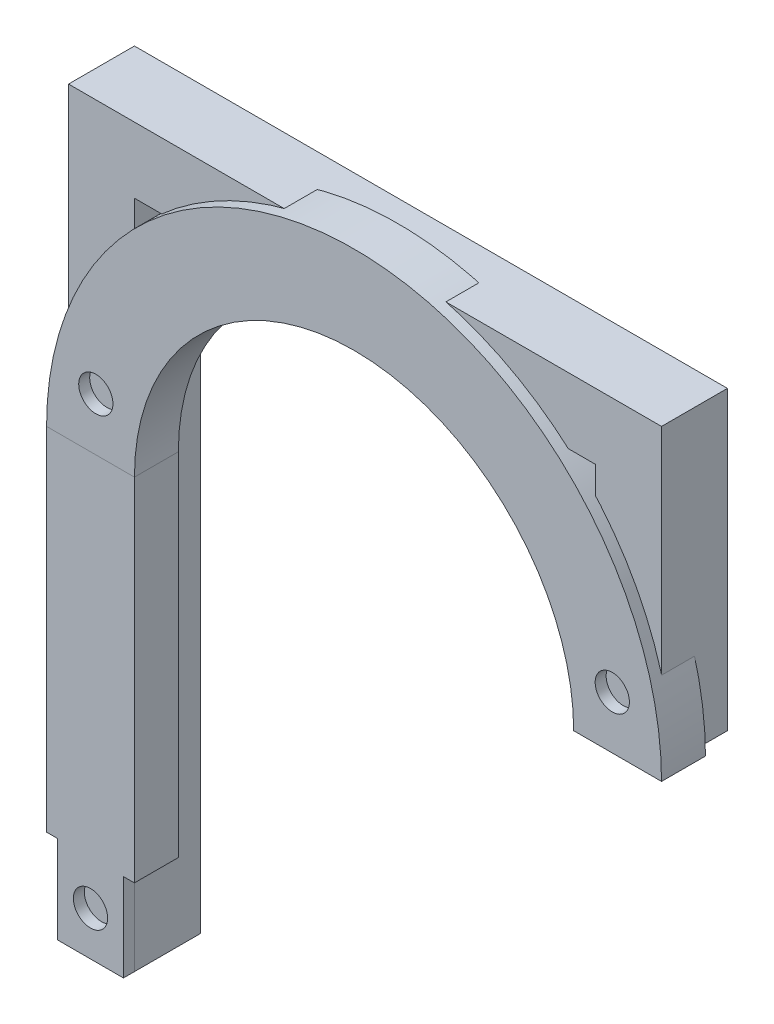
ISO-10303-21;
HEADER;
FILE_DESCRIPTION(('STEP AP214'),'2;1');
FILE_NAME('part.step','',(''),(''),'','','');
FILE_SCHEMA(('AUTOMOTIVE_DESIGN { 1 0 10303 214 1 1 1 1 }'));
ENDSEC;
DATA;
#1=APPLICATION_CONTEXT('core data for automotive mechanical design processes');
#2=APPLICATION_PROTOCOL_DEFINITION('international standard','automotive_design',2000,#1);
#3=PRODUCT_CONTEXT('',#1,'mechanical');
#4=PRODUCT('Part','Part','',(#3));
#5=PRODUCT_RELATED_PRODUCT_CATEGORY('part','',(#4));
#6=PRODUCT_DEFINITION_FORMATION('','',#4);
#7=PRODUCT_DEFINITION_CONTEXT('part definition',#1,'design');
#8=PRODUCT_DEFINITION('design','',#6,#7);
#9=PRODUCT_DEFINITION_SHAPE('','',#8);
#10=(LENGTH_UNIT() NAMED_UNIT(*) SI_UNIT(.MILLI.,.METRE.));
#11=(NAMED_UNIT(*) PLANE_ANGLE_UNIT() SI_UNIT($,.RADIAN.));
#12=(NAMED_UNIT(*) SI_UNIT($,.STERADIAN.) SOLID_ANGLE_UNIT());
#13=UNCERTAINTY_MEASURE_WITH_UNIT(LENGTH_MEASURE(1.E-05),#10,'distance_accuracy_value','');
#14=(GEOMETRIC_REPRESENTATION_CONTEXT(3) GLOBAL_UNCERTAINTY_ASSIGNED_CONTEXT((#13)) GLOBAL_UNIT_ASSIGNED_CONTEXT((#10,
#11,#12)) REPRESENTATION_CONTEXT('',''));
#15=CARTESIAN_POINT('',(0.,0.,0.));
#16=DIRECTION('',(0.,0.,1.));
#17=DIRECTION('',(1.,0.,0.));
#18=AXIS2_PLACEMENT_3D('',#15,#16,#17);
#19=CARTESIAN_POINT('',(-6.35,0.,0.));
#20=DIRECTION('',(-1.,0.,0.));
#21=DIRECTION('',(0.,0.,1.));
#22=AXIS2_PLACEMENT_3D('',#19,#20,#21);
#23=PLANE('',#22);
#24=DIRECTION('',(0.,1.,0.));
#25=VECTOR('',#24,1.);
#26=CARTESIAN_POINT('',(-6.35,0.,0.));
#27=LINE('',#26,#25);
#28=CARTESIAN_POINT('',(-6.35,12.7,0.));
#29=VERTEX_POINT('',#28);
#30=CARTESIAN_POINT('',(-6.35,63.5,0.));
#31=VERTEX_POINT('',#30);
#32=EDGE_CURVE('E160',#29,#31,#27,.T.);
#33=ORIENTED_EDGE('',*,*,#32,.F.);
#34=DIRECTION('',(0.,0.,-1.));
#35=VECTOR('',#34,1.);
#36=CARTESIAN_POINT('',(-6.35,12.7,6.35));
#37=LINE('',#36,#35);
#38=CARTESIAN_POINT('',(-6.35,12.7,6.35));
#39=VERTEX_POINT('',#38);
#40=EDGE_CURVE('E142',#39,#29,#37,.T.);
#41=ORIENTED_EDGE('',*,*,#40,.F.);
#42=DIRECTION('',(0.,1.,0.));
#43=VECTOR('',#42,1.);
#44=CARTESIAN_POINT('',(-6.35,0.,6.35));
#45=LINE('',#44,#43);
#46=CARTESIAN_POINT('',(-6.35,63.5,6.35));
#47=VERTEX_POINT('',#46);
#48=EDGE_CURVE('E172',#39,#47,#45,.T.);
#49=ORIENTED_EDGE('',*,*,#48,.T.);
#50=DIRECTION('',(0.,0.,1.));
#51=VECTOR('',#50,1.);
#52=CARTESIAN_POINT('',(-6.35,63.5,0.));
#53=LINE('',#52,#51);
#54=EDGE_CURVE('E169',#31,#47,#53,.T.);
#55=ORIENTED_EDGE('',*,*,#54,.F.);
#56=EDGE_LOOP('',(#33,#41,#49,#55));
#57=FACE_BOUND('',#56,.T.);
#58=ADVANCED_FACE('F45',(#57),#23,.T.);
#59=CARTESIAN_POINT('',(-6.35,0.,6.35));
#60=DIRECTION('',(0.,0.,1.));
#61=DIRECTION('',(1.,0.,0.));
#62=AXIS2_PLACEMENT_3D('',#59,#60,#61);
#63=PLANE('',#62);
#64=CARTESIAN_POINT('',(0.,6.35,6.35));
#65=DIRECTION('',(0.,0.,1.));
#66=DIRECTION('',(1.,0.,0.));
#67=AXIS2_PLACEMENT_3D('',#64,#65,#66);
#68=CIRCLE('',#67,2.4765);
#69=CARTESIAN_POINT('',(2.4765,6.35,6.35));
#70=VERTEX_POINT('',#69);
#71=EDGE_CURVE('E254',#70,#70,#68,.T.);
#72=ORIENTED_EDGE('',*,*,#71,.F.);
#73=EDGE_LOOP('',(#72));
#74=FACE_BOUND('',#73,.T.);
#75=ORIENTED_EDGE('',*,*,#48,.F.);
#76=DIRECTION('',(-1.,0.,0.));
#77=VECTOR('',#76,1.);
#78=CARTESIAN_POINT('',(-6.35,12.7,6.35));
#79=LINE('',#78,#77);
#80=CARTESIAN_POINT('',(-4.7625,12.7,6.35));
#81=VERTEX_POINT('',#80);
#82=EDGE_CURVE('E153',#81,#39,#79,.T.);
#83=ORIENTED_EDGE('',*,*,#82,.F.);
#84=DIRECTION('',(0.,1.,0.));
#85=VECTOR('',#84,1.);
#86=CARTESIAN_POINT('',(-4.7625,0.,6.35));
#87=LINE('',#86,#85);
#88=CARTESIAN_POINT('',(-4.7625,0.,6.35));
#89=VERTEX_POINT('',#88);
#90=EDGE_CURVE('E250',#89,#81,#87,.T.);
#91=ORIENTED_EDGE('',*,*,#90,.F.);
#92=DIRECTION('',(-1.,0.,0.));
#93=VECTOR('',#92,1.);
#94=CARTESIAN_POINT('',(-4.7625,0.,6.35));
#95=LINE('',#94,#93);
#96=CARTESIAN_POINT('',(4.7625,0.,6.35));
#97=VERTEX_POINT('',#96);
#98=EDGE_CURVE('E135',#97,#89,#95,.T.);
#99=ORIENTED_EDGE('',*,*,#98,.F.);
#100=DIRECTION('',(0.,1.,0.));
#101=VECTOR('',#100,1.);
#102=CARTESIAN_POINT('',(4.7625,0.,6.35));
#103=LINE('',#102,#101);
#104=CARTESIAN_POINT('',(4.7625,12.7,6.35));
#105=VERTEX_POINT('',#104);
#106=EDGE_CURVE('E146',#97,#105,#103,.T.);
#107=ORIENTED_EDGE('',*,*,#106,.T.);
#108=CARTESIAN_POINT('',(6.35,12.7,6.35));
#109=VERTEX_POINT('',#108);
#110=EDGE_CURVE('E154',#109,#105,#79,.T.);
#111=ORIENTED_EDGE('',*,*,#110,.F.);
#112=DIRECTION('',(0.,1.,0.));
#113=VECTOR('',#112,1.);
#114=CARTESIAN_POINT('',(6.35,0.,6.35));
#115=LINE('',#114,#113);
#116=CARTESIAN_POINT('',(6.35,63.5,6.35));
#117=VERTEX_POINT('',#116);
#118=EDGE_CURVE('E188',#109,#117,#115,.T.);
#119=ORIENTED_EDGE('',*,*,#118,.T.);
#120=DIRECTION('',(1.,0.,0.));
#121=VECTOR('',#120,1.);
#122=CARTESIAN_POINT('',(-6.35,63.5,6.35));
#123=LINE('',#122,#121);
#124=EDGE_CURVE('E174',#47,#117,#123,.T.);
#125=ORIENTED_EDGE('',*,*,#124,.F.);
#126=EDGE_LOOP('',(#75,#83,#91,#99,#107,#111,#119,#125));
#127=FACE_BOUND('',#126,.T.);
#128=ADVANCED_FACE('F240',(#74,#127),#63,.T.);
#129=CARTESIAN_POINT('',(6.35,0.,0.));
#130=DIRECTION('',(1.,0.,0.));
#131=DIRECTION('',(0.,0.,-1.));
#132=AXIS2_PLACEMENT_3D('',#129,#130,#131);
#133=PLANE('',#132);
#134=ORIENTED_EDGE('',*,*,#118,.F.);
#135=DIRECTION('',(0.,0.,1.));
#136=VECTOR('',#135,1.);
#137=CARTESIAN_POINT('',(6.35,12.7,6.35));
#138=LINE('',#137,#136);
#139=CARTESIAN_POINT('',(6.35,12.7,0.));
#140=VERTEX_POINT('',#139);
#141=EDGE_CURVE('E151',#140,#109,#138,.T.);
#142=ORIENTED_EDGE('',*,*,#141,.F.);
#143=DIRECTION('',(0.,1.,0.));
#144=VECTOR('',#143,1.);
#145=CARTESIAN_POINT('',(6.35,0.,0.));
#146=LINE('',#145,#144);
#147=CARTESIAN_POINT('',(6.35,63.5,0.));
#148=VERTEX_POINT('',#147);
#149=EDGE_CURVE('E198',#140,#148,#146,.T.);
#150=ORIENTED_EDGE('',*,*,#149,.T.);
#151=DIRECTION('',(0.,0.,-1.));
#152=VECTOR('',#151,1.);
#153=CARTESIAN_POINT('',(6.35,63.5,0.));
#154=LINE('',#153,#152);
#155=EDGE_CURVE('E190',#117,#148,#154,.T.);
#156=ORIENTED_EDGE('',*,*,#155,.F.);
#157=EDGE_LOOP('',(#134,#142,#150,#156));
#158=FACE_BOUND('',#157,.T.);
#159=ADVANCED_FACE('F233',(#158),#133,.T.);
#160=CARTESIAN_POINT('',(-6.35,0.,0.));
#161=DIRECTION('',(0.,0.,-1.));
#162=DIRECTION('',(-1.,0.,0.));
#163=AXIS2_PLACEMENT_3D('',#160,#161,#162);
#164=PLANE('',#163);
#165=ORIENTED_EDGE('',*,*,#149,.F.);
#166=DIRECTION('',(1.,0.,0.));
#167=VECTOR('',#166,1.);
#168=CARTESIAN_POINT('',(-6.35,12.7,0.));
#169=LINE('',#168,#167);
#170=EDGE_CURVE('E144',#29,#140,#169,.T.);
#171=ORIENTED_EDGE('',*,*,#170,.F.);
#172=ORIENTED_EDGE('',*,*,#32,.T.);
#173=DIRECTION('',(-1.,0.,0.));
#174=VECTOR('',#173,1.);
#175=CARTESIAN_POINT('',(-6.35,63.5,0.));
#176=LINE('',#175,#174);
#177=EDGE_CURVE('E185',#148,#31,#176,.T.);
#178=ORIENTED_EDGE('',*,*,#177,.F.);
#179=EDGE_LOOP('',(#165,#171,#172,#178));
#180=FACE_BOUND('',#179,.T.);
#181=ADVANCED_FACE('F236',(#180),#164,.T.);
#182=CARTESIAN_POINT('',(76.2,63.5,0.));
#183=DIRECTION('',(0.,-1.,0.));
#184=DIRECTION('',(0.,0.,1.));
#185=AXIS2_PLACEMENT_3D('',#182,#183,#184);
#186=PLANE('',#185);
#187=DIRECTION('',(0.,0.,-1.));
#188=VECTOR('',#187,1.);
#189=CARTESIAN_POINT('',(69.85,63.5,0.));
#190=LINE('',#189,#188);
#191=CARTESIAN_POINT('',(69.85,63.5,6.35));
#192=VERTEX_POINT('',#191);
#193=CARTESIAN_POINT('',(69.85,63.5,0.));
#194=VERTEX_POINT('',#193);
#195=EDGE_CURVE('E195',#192,#194,#190,.T.);
#196=ORIENTED_EDGE('',*,*,#195,.T.);
#197=DIRECTION('',(1.,0.,0.));
#198=VECTOR('',#197,1.);
#199=CARTESIAN_POINT('',(82.55,63.5,0.));
#200=LINE('',#199,#198);
#201=CARTESIAN_POINT('',(82.55,63.5,0.));
#202=VERTEX_POINT('',#201);
#203=EDGE_CURVE('E12',#194,#202,#200,.T.);
#204=ORIENTED_EDGE('',*,*,#203,.T.);
#205=DIRECTION('',(0.,0.,1.));
#206=VECTOR('',#205,1.);
#207=CARTESIAN_POINT('',(82.55,63.5,0.));
#208=LINE('',#207,#206);
#209=CARTESIAN_POINT('',(82.55,63.5,6.35));
#210=VERTEX_POINT('',#209);
#211=EDGE_CURVE('E176',#202,#210,#208,.T.);
#212=ORIENTED_EDGE('',*,*,#211,.T.);
#213=DIRECTION('',(-1.,0.,0.));
#214=VECTOR('',#213,1.);
#215=CARTESIAN_POINT('',(82.55,63.5,6.35));
#216=LINE('',#215,#214);
#217=EDGE_CURVE('E182',#210,#192,#216,.T.);
#218=ORIENTED_EDGE('',*,*,#217,.T.);
#219=EDGE_LOOP('',(#196,#204,#212,#218));
#220=FACE_BOUND('',#219,.T.);
#221=ADVANCED_FACE('F47',(#220),#186,.T.);
#222=CARTESIAN_POINT('',(38.1,63.5,0.));
#223=DIRECTION('',(0.,0.,-1.));
#224=DIRECTION('',(-1.,0.,0.));
#225=AXIS2_PLACEMENT_3D('',#222,#223,#224);
#226=CYLINDRICAL_SURFACE('',#225,44.45);
#227=CARTESIAN_POINT('',(38.1,63.5,6.35));
#228=DIRECTION('',(0.,0.,-1.));
#229=DIRECTION('',(-1.,0.,0.));
#230=AXIS2_PLACEMENT_3D('',#227,#228,#229);
#231=CIRCLE('',#230,44.45);
#232=EDGE_CURVE('E178',#47,#210,#231,.T.);
#233=ORIENTED_EDGE('',*,*,#232,.T.);
#234=ORIENTED_EDGE('',*,*,#211,.F.);
#235=CARTESIAN_POINT('',(38.1,63.5,0.));
#236=DIRECTION('',(0.,0.,-1.));
#237=DIRECTION('',(-1.,0.,0.));
#238=AXIS2_PLACEMENT_3D('',#235,#236,#237);
#239=CIRCLE('',#238,44.45);
#240=EDGE_CURVE('E179',#31,#202,#239,.T.);
#241=ORIENTED_EDGE('',*,*,#240,.F.);
#242=ORIENTED_EDGE('',*,*,#54,.T.);
#243=EDGE_LOOP('',(#233,#234,#241,#242));
#244=FACE_BOUND('',#243,.T.);
#245=ADVANCED_FACE('F219',(#244),#226,.T.);
#246=CARTESIAN_POINT('',(-6.35,63.5,6.35));
#247=DIRECTION('',(0.,0.,1.));
#248=DIRECTION('',(1.,0.,0.));
#249=AXIS2_PLACEMENT_3D('',#246,#247,#248);
#250=PLANE('',#249);
#251=CARTESIAN_POINT('',(75.4302236800156,71.12,6.35));
#252=DIRECTION('',(0.,0.,1.));
#253=DIRECTION('',(1.,0.,0.));
#254=AXIS2_PLACEMENT_3D('',#251,#252,#253);
#255=CIRCLE('',#254,2.4765);
#256=CARTESIAN_POINT('',(77.9067236800156,71.12,6.35));
#257=VERTEX_POINT('',#256);
#258=EDGE_CURVE('E157',#257,#257,#255,.T.);
#259=ORIENTED_EDGE('',*,*,#258,.F.);
#260=EDGE_LOOP('',(#259));
#261=FACE_BOUND('',#260,.T.);
#262=CARTESIAN_POINT('',(0.769776319984358,71.12,6.35));
#263=DIRECTION('',(0.,0.,1.));
#264=DIRECTION('',(-1.,0.,0.));
#265=AXIS2_PLACEMENT_3D('',#262,#263,#264);
#266=CIRCLE('',#265,2.4765);
#267=CARTESIAN_POINT('',(-1.70672368001564,71.12,6.35));
#268=VERTEX_POINT('',#267);
#269=EDGE_CURVE('E164',#268,#268,#266,.T.);
#270=ORIENTED_EDGE('',*,*,#269,.F.);
#271=EDGE_LOOP('',(#270));
#272=FACE_BOUND('',#271,.T.);
#273=CARTESIAN_POINT('',(38.1,63.5,6.35));
#274=DIRECTION('',(0.,0.,-1.));
#275=DIRECTION('',(-1.,0.,0.));
#276=AXIS2_PLACEMENT_3D('',#273,#274,#275);
#277=CIRCLE('',#276,31.75);
#278=EDGE_CURVE('E192',#117,#192,#277,.T.);
#279=ORIENTED_EDGE('',*,*,#278,.T.);
#280=ORIENTED_EDGE('',*,*,#217,.F.);
#281=ORIENTED_EDGE('',*,*,#232,.F.);
#282=ORIENTED_EDGE('',*,*,#124,.T.);
#283=EDGE_LOOP('',(#279,#280,#281,#282));
#284=FACE_BOUND('',#283,.T.);
#285=ADVANCED_FACE('F225',(#261,#272,#284),#250,.T.);
#286=CARTESIAN_POINT('',(38.1,63.5,0.));
#287=DIRECTION('',(0.,0.,-1.));
#288=DIRECTION('',(-1.,0.,0.));
#289=AXIS2_PLACEMENT_3D('',#286,#287,#288);
#290=CYLINDRICAL_SURFACE('',#289,31.75);
#291=CARTESIAN_POINT('',(38.1,63.5,0.));
#292=DIRECTION('',(0.,0.,-1.));
#293=DIRECTION('',(-1.,0.,0.));
#294=AXIS2_PLACEMENT_3D('',#291,#292,#293);
#295=CIRCLE('',#294,31.75);
#296=EDGE_CURVE('E54',#148,#194,#295,.T.);
#297=ORIENTED_EDGE('',*,*,#296,.T.);
#298=ORIENTED_EDGE('',*,*,#195,.F.);
#299=ORIENTED_EDGE('',*,*,#278,.F.);
#300=ORIENTED_EDGE('',*,*,#155,.T.);
#301=EDGE_LOOP('',(#297,#298,#299,#300));
#302=FACE_BOUND('',#301,.T.);
#303=ADVANCED_FACE('F230',(#302),#290,.F.);
#304=CARTESIAN_POINT('',(-6.35,63.5,0.));
#305=DIRECTION('',(0.,0.,-1.));
#306=DIRECTION('',(-1.,0.,0.));
#307=AXIS2_PLACEMENT_3D('',#304,#305,#306);
#308=PLANE('',#307);
#309=CARTESIAN_POINT('',(75.4302236800156,71.12,0.));
#310=DIRECTION('',(0.,0.,1.));
#311=DIRECTION('',(1.,0.,0.));
#312=AXIS2_PLACEMENT_3D('',#309,#310,#311);
#313=CIRCLE('',#312,2.4765);
#314=CARTESIAN_POINT('',(77.9067236800156,71.12,0.));
#315=VERTEX_POINT('',#314);
#316=EDGE_CURVE('E161',#315,#315,#313,.T.);
#317=ORIENTED_EDGE('',*,*,#316,.T.);
#318=EDGE_LOOP('',(#317));
#319=FACE_BOUND('',#318,.T.);
#320=CARTESIAN_POINT('',(0.769776319984358,71.12,0.));
#321=DIRECTION('',(0.,0.,1.));
#322=DIRECTION('',(-1.,0.,0.));
#323=AXIS2_PLACEMENT_3D('',#320,#321,#322);
#324=CIRCLE('',#323,2.4765);
#325=CARTESIAN_POINT('',(-1.70672368001564,71.12,0.));
#326=VERTEX_POINT('',#325);
#327=EDGE_CURVE('E156',#326,#326,#324,.T.);
#328=ORIENTED_EDGE('',*,*,#327,.T.);
#329=EDGE_LOOP('',(#328));
#330=FACE_BOUND('',#329,.T.);
#331=ORIENTED_EDGE('',*,*,#203,.F.);
#332=ORIENTED_EDGE('',*,*,#296,.F.);
#333=ORIENTED_EDGE('',*,*,#177,.T.);
#334=ORIENTED_EDGE('',*,*,#240,.T.);
#335=EDGE_LOOP('',(#331,#332,#333,#334));
#336=FACE_BOUND('',#335,.T.);
#337=ADVANCED_FACE('F209',(#319,#330,#336),#308,.T.);
#338=CARTESIAN_POINT('',(0.769776319984358,71.12,6.35));
#339=DIRECTION('',(0.,0.,-1.));
#340=DIRECTION('',(-1.,0.,0.));
#341=AXIS2_PLACEMENT_3D('',#338,#339,#340);
#342=CYLINDRICAL_SURFACE('',#341,2.4765);
#343=ORIENTED_EDGE('',*,*,#269,.T.);
#344=EDGE_LOOP('',(#343));
#345=FACE_BOUND('',#344,.T.);
#346=ORIENTED_EDGE('',*,*,#327,.F.);
#347=EDGE_LOOP('',(#346));
#348=FACE_BOUND('',#347,.T.);
#349=ADVANCED_FACE('F283',(#345,#348),#342,.F.);
#350=CARTESIAN_POINT('',(75.4302236800156,71.12,6.35));
#351=DIRECTION('',(0.,0.,-1.));
#352=DIRECTION('',(-1.,0.,0.));
#353=AXIS2_PLACEMENT_3D('',#350,#351,#352);
#354=CYLINDRICAL_SURFACE('',#353,2.4765);
#355=ORIENTED_EDGE('',*,*,#258,.T.);
#356=EDGE_LOOP('',(#355));
#357=FACE_BOUND('',#356,.T.);
#358=ORIENTED_EDGE('',*,*,#316,.F.);
#359=EDGE_LOOP('',(#358));
#360=FACE_BOUND('',#359,.T.);
#361=ADVANCED_FACE('F288',(#357,#360),#354,.F.);
#362=CARTESIAN_POINT('',(0.,12.7,0.));
#363=DIRECTION('',(0.,-1.,0.));
#364=DIRECTION('',(0.,0.,-1.));
#365=AXIS2_PLACEMENT_3D('',#362,#363,#364);
#366=PLANE('',#365);
#367=DIRECTION('',(0.,0.,-1.));
#368=VECTOR('',#367,1.);
#369=CARTESIAN_POINT('',(-4.7625,12.7,1.5875));
#370=LINE('',#369,#368);
#371=CARTESIAN_POINT('',(-4.7625,12.7,1.5875));
#372=VERTEX_POINT('',#371);
#373=EDGE_CURVE('E66',#81,#372,#370,.T.);
#374=ORIENTED_EDGE('',*,*,#373,.F.);
#375=ORIENTED_EDGE('',*,*,#82,.T.);
#376=ORIENTED_EDGE('',*,*,#40,.T.);
#377=ORIENTED_EDGE('',*,*,#170,.T.);
#378=ORIENTED_EDGE('',*,*,#141,.T.);
#379=ORIENTED_EDGE('',*,*,#110,.T.);
#380=DIRECTION('',(0.,0.,1.));
#381=VECTOR('',#380,1.);
#382=CARTESIAN_POINT('',(4.7625,12.7,1.5875));
#383=LINE('',#382,#381);
#384=CARTESIAN_POINT('',(4.7625,12.7,1.5875));
#385=VERTEX_POINT('',#384);
#386=EDGE_CURVE('E139',#385,#105,#383,.T.);
#387=ORIENTED_EDGE('',*,*,#386,.F.);
#388=DIRECTION('',(1.,0.,0.));
#389=VECTOR('',#388,1.);
#390=CARTESIAN_POINT('',(-4.7625,12.7,1.5875));
#391=LINE('',#390,#389);
#392=EDGE_CURVE('E61',#372,#385,#391,.T.);
#393=ORIENTED_EDGE('',*,*,#392,.F.);
#394=EDGE_LOOP('',(#374,#375,#376,#377,#378,#379,#387,#393));
#395=FACE_BOUND('',#394,.T.);
#396=ADVANCED_FACE('F237',(#395),#366,.T.);
#397=CARTESIAN_POINT('',(-4.7625,0.,1.5875));
#398=DIRECTION('',(1.,0.,0.));
#399=DIRECTION('',(0.,0.,-1.));
#400=AXIS2_PLACEMENT_3D('',#397,#398,#399);
#401=PLANE('',#400);
#402=ORIENTED_EDGE('',*,*,#373,.T.);
#403=DIRECTION('',(0.,1.,0.));
#404=VECTOR('',#403,1.);
#405=CARTESIAN_POINT('',(-4.7625,0.,1.5875));
#406=LINE('',#405,#404);
#407=CARTESIAN_POINT('',(-4.7625,0.,1.5875));
#408=VERTEX_POINT('',#407);
#409=EDGE_CURVE('E124',#408,#372,#406,.T.);
#410=ORIENTED_EDGE('',*,*,#409,.F.);
#411=DIRECTION('',(0.,0.,-1.));
#412=VECTOR('',#411,1.);
#413=CARTESIAN_POINT('',(-4.7625,0.,1.5875));
#414=LINE('',#413,#412);
#415=EDGE_CURVE('E130',#89,#408,#414,.T.);
#416=ORIENTED_EDGE('',*,*,#415,.F.);
#417=ORIENTED_EDGE('',*,*,#90,.T.);
#418=EDGE_LOOP('',(#402,#410,#416,#417));
#419=FACE_BOUND('',#418,.T.);
#420=ADVANCED_FACE('F141',(#419),#401,.F.);
#421=CARTESIAN_POINT('',(-4.7625,0.,1.5875));
#422=DIRECTION('',(0.,0.,1.));
#423=DIRECTION('',(1.,0.,0.));
#424=AXIS2_PLACEMENT_3D('',#421,#422,#423);
#425=PLANE('',#424);
#426=CARTESIAN_POINT('',(0.,6.35,1.5875));
#427=DIRECTION('',(0.,0.,1.));
#428=DIRECTION('',(1.,0.,0.));
#429=AXIS2_PLACEMENT_3D('',#426,#427,#428);
#430=CIRCLE('',#429,2.4765);
#431=CARTESIAN_POINT('',(2.4765,6.35,1.5875));
#432=VERTEX_POINT('',#431);
#433=EDGE_CURVE('E49',#432,#432,#430,.T.);
#434=ORIENTED_EDGE('',*,*,#433,.T.);
#435=EDGE_LOOP('',(#434));
#436=FACE_BOUND('',#435,.T.);
#437=ORIENTED_EDGE('',*,*,#392,.T.);
#438=DIRECTION('',(0.,1.,0.));
#439=VECTOR('',#438,1.);
#440=CARTESIAN_POINT('',(4.7625,0.,1.5875));
#441=LINE('',#440,#439);
#442=CARTESIAN_POINT('',(4.7625,0.,1.5875));
#443=VERTEX_POINT('',#442);
#444=EDGE_CURVE('E126',#443,#385,#441,.T.);
#445=ORIENTED_EDGE('',*,*,#444,.F.);
#446=DIRECTION('',(1.,0.,0.));
#447=VECTOR('',#446,1.);
#448=CARTESIAN_POINT('',(-4.7625,0.,1.5875));
#449=LINE('',#448,#447);
#450=EDGE_CURVE('E120',#408,#443,#449,.T.);
#451=ORIENTED_EDGE('',*,*,#450,.F.);
#452=ORIENTED_EDGE('',*,*,#409,.T.);
#453=EDGE_LOOP('',(#437,#445,#451,#452));
#454=FACE_BOUND('',#453,.T.);
#455=ADVANCED_FACE('F122',(#436,#454),#425,.F.);
#456=CARTESIAN_POINT('',(4.7625,0.,1.5875));
#457=DIRECTION('',(-1.,0.,0.));
#458=DIRECTION('',(0.,0.,1.));
#459=AXIS2_PLACEMENT_3D('',#456,#457,#458);
#460=PLANE('',#459);
#461=ORIENTED_EDGE('',*,*,#386,.T.);
#462=ORIENTED_EDGE('',*,*,#106,.F.);
#463=DIRECTION('',(0.,0.,1.));
#464=VECTOR('',#463,1.);
#465=CARTESIAN_POINT('',(4.7625,0.,1.5875));
#466=LINE('',#465,#464);
#467=EDGE_CURVE('E129',#443,#97,#466,.T.);
#468=ORIENTED_EDGE('',*,*,#467,.F.);
#469=ORIENTED_EDGE('',*,*,#444,.T.);
#470=EDGE_LOOP('',(#461,#462,#468,#469));
#471=FACE_BOUND('',#470,.T.);
#472=ADVANCED_FACE('F245',(#471),#460,.F.);
#473=CARTESIAN_POINT('',(0.,0.,0.));
#474=DIRECTION('',(0.,1.,0.));
#475=DIRECTION('',(0.,0.,1.));
#476=AXIS2_PLACEMENT_3D('',#473,#474,#475);
#477=PLANE('',#476);
#478=ORIENTED_EDGE('',*,*,#415,.T.);
#479=ORIENTED_EDGE('',*,*,#450,.T.);
#480=ORIENTED_EDGE('',*,*,#467,.T.);
#481=ORIENTED_EDGE('',*,*,#98,.T.);
#482=EDGE_LOOP('',(#478,#479,#480,#481));
#483=FACE_BOUND('',#482,.T.);
#484=ADVANCED_FACE('F133',(#483),#477,.F.);
#485=CARTESIAN_POINT('',(0.,6.35,-4.7625));
#486=DIRECTION('',(0.,0.,1.));
#487=DIRECTION('',(1.,0.,0.));
#488=AXIS2_PLACEMENT_3D('',#485,#486,#487);
#489=CYLINDRICAL_SURFACE('',#488,2.4765);
#490=ORIENTED_EDGE('',*,*,#71,.T.);
#491=EDGE_LOOP('',(#490));
#492=FACE_BOUND('',#491,.T.);
#493=ORIENTED_EDGE('',*,*,#433,.F.);
#494=EDGE_LOOP('',(#493));
#495=FACE_BOUND('',#494,.T.);
#496=ADVANCED_FACE('F261',(#492,#495),#489,.F.);
#497=CLOSED_SHELL('',(#58,#128,#159,#181,#221,#245,#285,#303,#337,#349,#361,#396,#420,#455,#472,
#484,#496));
#498=MANIFOLD_SOLID_BREP('B2',#497);
#499=CARTESIAN_POINT('',(71.4375,101.6,4.7625));
#500=DIRECTION('',(1.,0.,0.));
#501=DIRECTION('',(0.,0.,-1.));
#502=AXIS2_PLACEMENT_3D('',#499,#500,#501);
#503=PLANE('',#502);
#504=DIRECTION('',(0.,1.,0.));
#505=VECTOR('',#504,1.);
#506=CARTESIAN_POINT('',(71.4375,101.6,-4.7625));
#507=LINE('',#506,#505);
#508=CARTESIAN_POINT('',(71.4375,96.8375,-4.7625));
#509=VERTEX_POINT('',#508);
#510=CARTESIAN_POINT('',(71.4375,63.5,-4.7625));
#511=VERTEX_POINT('',#510);
#512=EDGE_CURVE('E514',#509,#511,#507,.F.);
#513=ORIENTED_EDGE('',*,*,#512,.T.);
#514=DIRECTION('',(0.,0.,-1.));
#515=VECTOR('',#514,1.);
#516=CARTESIAN_POINT('',(71.4375,63.5,4.7625));
#517=LINE('',#516,#515);
#518=CARTESIAN_POINT('',(71.4375,63.5,4.7625));
#519=VERTEX_POINT('',#518);
#520=EDGE_CURVE('E43',#519,#511,#517,.T.);
#521=ORIENTED_EDGE('',*,*,#520,.F.);
#522=DIRECTION('',(0.,1.,0.));
#523=VECTOR('',#522,1.);
#524=CARTESIAN_POINT('',(71.4375,101.6,4.7625));
#525=LINE('',#524,#523);
#526=CARTESIAN_POINT('',(71.4375,96.8375,4.7625));
#527=VERTEX_POINT('',#526);
#528=EDGE_CURVE('E472',#527,#519,#525,.F.);
#529=ORIENTED_EDGE('',*,*,#528,.F.);
#530=DIRECTION('',(0.,0.,-1.));
#531=VECTOR('',#530,1.);
#532=CARTESIAN_POINT('',(71.4375,96.8375,4.7625));
#533=LINE('',#532,#531);
#534=EDGE_CURVE('E513',#527,#509,#533,.T.);
#535=ORIENTED_EDGE('',*,*,#534,.T.);
#536=EDGE_LOOP('',(#513,#521,#529,#535));
#537=FACE_BOUND('',#536,.T.);
#538=ADVANCED_FACE('F417',(#537),#503,.F.);
#539=CARTESIAN_POINT('',(80.9625,63.5,4.7625));
#540=DIRECTION('',(0.,-1.,0.));
#541=DIRECTION('',(0.,0.,-1.));
#542=AXIS2_PLACEMENT_3D('',#539,#540,#541);
#543=PLANE('',#542);
#544=DIRECTION('',(-1.,0.,0.));
#545=VECTOR('',#544,1.);
#546=CARTESIAN_POINT('',(80.9625,63.5,-4.7625));
#547=LINE('',#546,#545);
#548=CARTESIAN_POINT('',(80.9625,63.5,-4.7625));
#549=VERTEX_POINT('',#548);
#550=EDGE_CURVE('E517',#549,#511,#547,.T.);
#551=ORIENTED_EDGE('',*,*,#550,.F.);
#552=DIRECTION('',(0.,0.,-1.));
#553=VECTOR('',#552,1.);
#554=CARTESIAN_POINT('',(80.9625,63.5,4.7625));
#555=LINE('',#554,#553);
#556=CARTESIAN_POINT('',(80.9625,63.5,4.7625));
#557=VERTEX_POINT('',#556);
#558=EDGE_CURVE('E425',#557,#549,#555,.T.);
#559=ORIENTED_EDGE('',*,*,#558,.F.);
#560=DIRECTION('',(-1.,0.,0.));
#561=VECTOR('',#560,1.);
#562=CARTESIAN_POINT('',(80.9625,63.5,4.7625));
#563=LINE('',#562,#561);
#564=EDGE_CURVE('E556',#557,#519,#563,.T.);
#565=ORIENTED_EDGE('',*,*,#564,.T.);
#566=ORIENTED_EDGE('',*,*,#520,.T.);
#567=EDGE_LOOP('',(#551,#559,#565,#566));
#568=FACE_BOUND('',#567,.T.);
#569=ADVANCED_FACE('F547',(#568),#543,.T.);
#570=CARTESIAN_POINT('',(80.9625,101.6,4.7625));
#571=DIRECTION('',(1.,0.,0.));
#572=DIRECTION('',(0.,0.,-1.));
#573=AXIS2_PLACEMENT_3D('',#570,#571,#572);
#574=PLANE('',#573);
#575=DIRECTION('',(0.,1.,0.));
#576=VECTOR('',#575,1.);
#577=CARTESIAN_POINT('',(80.9625,101.6,-4.7625));
#578=LINE('',#577,#576);
#579=CARTESIAN_POINT('',(80.9625,106.3625,-4.7625));
#580=VERTEX_POINT('',#579);
#581=EDGE_CURVE('E520',#580,#549,#578,.F.);
#582=ORIENTED_EDGE('',*,*,#581,.F.);
#583=DIRECTION('',(0.,0.,-1.));
#584=VECTOR('',#583,1.);
#585=CARTESIAN_POINT('',(80.9625,106.3625,4.7625));
#586=LINE('',#585,#584);
#587=CARTESIAN_POINT('',(80.9625,106.3625,4.7625));
#588=VERTEX_POINT('',#587);
#589=EDGE_CURVE('E537',#588,#580,#586,.T.);
#590=ORIENTED_EDGE('',*,*,#589,.F.);
#591=DIRECTION('',(0.,1.,0.));
#592=VECTOR('',#591,1.);
#593=CARTESIAN_POINT('',(80.9625,101.6,4.7625));
#594=LINE('',#593,#592);
#595=EDGE_CURVE('E544',#588,#557,#594,.F.);
#596=ORIENTED_EDGE('',*,*,#595,.T.);
#597=ORIENTED_EDGE('',*,*,#558,.T.);
#598=EDGE_LOOP('',(#582,#590,#596,#597));
#599=FACE_BOUND('',#598,.T.);
#600=ADVANCED_FACE('F542',(#599),#574,.T.);
#601=CARTESIAN_POINT('',(0.,106.3625,4.7625));
#602=DIRECTION('',(0.,1.,0.));
#603=DIRECTION('',(0.,0.,1.));
#604=AXIS2_PLACEMENT_3D('',#601,#602,#603);
#605=PLANE('',#604);
#606=DIRECTION('',(1.,0.,0.));
#607=VECTOR('',#606,1.);
#608=CARTESIAN_POINT('',(0.,106.3625,-4.7625));
#609=LINE('',#608,#607);
#610=CARTESIAN_POINT('',(-4.7625,106.3625,-4.7625));
#611=VERTEX_POINT('',#610);
#612=EDGE_CURVE('E523',#611,#580,#609,.T.);
#613=ORIENTED_EDGE('',*,*,#612,.F.);
#614=DIRECTION('',(0.,0.,-1.));
#615=VECTOR('',#614,1.);
#616=CARTESIAN_POINT('',(-4.7625,106.3625,4.7625));
#617=LINE('',#616,#615);
#618=CARTESIAN_POINT('',(-4.7625,106.3625,4.7625));
#619=VERTEX_POINT('',#618);
#620=EDGE_CURVE('E535',#619,#611,#617,.T.);
#621=ORIENTED_EDGE('',*,*,#620,.F.);
#622=DIRECTION('',(1.,0.,0.));
#623=VECTOR('',#622,1.);
#624=CARTESIAN_POINT('',(0.,106.3625,4.7625));
#625=LINE('',#624,#623);
#626=EDGE_CURVE('E508',#619,#588,#625,.T.);
#627=ORIENTED_EDGE('',*,*,#626,.T.);
#628=ORIENTED_EDGE('',*,*,#589,.T.);
#629=EDGE_LOOP('',(#613,#621,#627,#628));
#630=FACE_BOUND('',#629,.T.);
#631=ADVANCED_FACE('F554',(#630),#605,.T.);
#632=CARTESIAN_POINT('',(-4.7625,0.,4.7625));
#633=DIRECTION('',(-1.,0.,0.));
#634=DIRECTION('',(0.,0.,1.));
#635=AXIS2_PLACEMENT_3D('',#632,#633,#634);
#636=PLANE('',#635);
#637=DIRECTION('',(0.,1.,0.));
#638=VECTOR('',#637,1.);
#639=CARTESIAN_POINT('',(-4.7625,0.,-4.7625));
#640=LINE('',#639,#638);
#641=CARTESIAN_POINT('',(-4.7625,0.,-4.7625));
#642=VERTEX_POINT('',#641);
#643=EDGE_CURVE('E526',#642,#611,#640,.T.);
#644=ORIENTED_EDGE('',*,*,#643,.F.);
#645=DIRECTION('',(0.,0.,-1.));
#646=VECTOR('',#645,1.);
#647=CARTESIAN_POINT('',(-4.7625,0.,4.7625));
#648=LINE('',#647,#646);
#649=CARTESIAN_POINT('',(-4.7625,0.,4.7625));
#650=VERTEX_POINT('',#649);
#651=EDGE_CURVE('E496',#650,#642,#648,.T.);
#652=ORIENTED_EDGE('',*,*,#651,.F.);
#653=DIRECTION('',(0.,1.,0.));
#654=VECTOR('',#653,1.);
#655=CARTESIAN_POINT('',(-4.7625,0.,4.7625));
#656=LINE('',#655,#654);
#657=EDGE_CURVE('E506',#650,#619,#656,.T.);
#658=ORIENTED_EDGE('',*,*,#657,.T.);
#659=ORIENTED_EDGE('',*,*,#620,.T.);
#660=EDGE_LOOP('',(#644,#652,#658,#659));
#661=FACE_BOUND('',#660,.T.);
#662=ADVANCED_FACE('F561',(#661),#636,.T.);
#663=CARTESIAN_POINT('',(4.7625,0.,4.7625));
#664=DIRECTION('',(0.,-1.,0.));
#665=DIRECTION('',(0.,0.,-1.));
#666=AXIS2_PLACEMENT_3D('',#663,#664,#665);
#667=PLANE('',#666);
#668=DIRECTION('',(-1.,0.,0.));
#669=VECTOR('',#668,1.);
#670=CARTESIAN_POINT('',(4.7625,0.,-4.7625));
#671=LINE('',#670,#669);
#672=CARTESIAN_POINT('',(4.7625,0.,-4.7625));
#673=VERTEX_POINT('',#672);
#674=EDGE_CURVE('E495',#673,#642,#671,.T.);
#675=ORIENTED_EDGE('',*,*,#674,.F.);
#676=DIRECTION('',(0.,0.,-1.));
#677=VECTOR('',#676,1.);
#678=CARTESIAN_POINT('',(4.7625,0.,4.7625));
#679=LINE('',#678,#677);
#680=CARTESIAN_POINT('',(4.7625,0.,4.7625));
#681=VERTEX_POINT('',#680);
#682=EDGE_CURVE('E489',#681,#673,#679,.T.);
#683=ORIENTED_EDGE('',*,*,#682,.F.);
#684=DIRECTION('',(-1.,0.,0.));
#685=VECTOR('',#684,1.);
#686=CARTESIAN_POINT('',(4.7625,0.,4.7625));
#687=LINE('',#686,#685);
#688=EDGE_CURVE('E493',#681,#650,#687,.T.);
#689=ORIENTED_EDGE('',*,*,#688,.T.);
#690=ORIENTED_EDGE('',*,*,#651,.T.);
#691=EDGE_LOOP('',(#675,#683,#689,#690));
#692=FACE_BOUND('',#691,.T.);
#693=ADVANCED_FACE('F491',(#692),#667,.T.);
#694=CARTESIAN_POINT('',(4.7625,0.,4.7625));
#695=DIRECTION('',(-1.,0.,0.));
#696=DIRECTION('',(0.,0.,1.));
#697=AXIS2_PLACEMENT_3D('',#694,#695,#696);
#698=PLANE('',#697);
#699=DIRECTION('',(0.,1.,0.));
#700=VECTOR('',#699,1.);
#701=CARTESIAN_POINT('',(4.7625,0.,-4.7625));
#702=LINE('',#701,#700);
#703=CARTESIAN_POINT('',(4.7625,96.8375,-4.7625));
#704=VERTEX_POINT('',#703);
#705=EDGE_CURVE('E460',#673,#704,#702,.T.);
#706=ORIENTED_EDGE('',*,*,#705,.T.);
#707=DIRECTION('',(0.,0.,-1.));
#708=VECTOR('',#707,1.);
#709=CARTESIAN_POINT('',(4.7625,96.8375,4.7625));
#710=LINE('',#709,#708);
#711=CARTESIAN_POINT('',(4.7625,96.8375,4.7625));
#712=VERTEX_POINT('',#711);
#713=EDGE_CURVE('E497',#712,#704,#710,.T.);
#714=ORIENTED_EDGE('',*,*,#713,.F.);
#715=DIRECTION('',(0.,1.,0.));
#716=VECTOR('',#715,1.);
#717=CARTESIAN_POINT('',(4.7625,0.,4.7625));
#718=LINE('',#717,#716);
#719=EDGE_CURVE('E499',#681,#712,#718,.T.);
#720=ORIENTED_EDGE('',*,*,#719,.F.);
#721=ORIENTED_EDGE('',*,*,#682,.T.);
#722=EDGE_LOOP('',(#706,#714,#720,#721));
#723=FACE_BOUND('',#722,.T.);
#724=ADVANCED_FACE('F500',(#723),#698,.F.);
#725=CARTESIAN_POINT('',(0.,96.8375,4.7625));
#726=DIRECTION('',(0.,1.,0.));
#727=DIRECTION('',(0.,0.,1.));
#728=AXIS2_PLACEMENT_3D('',#725,#726,#727);
#729=PLANE('',#728);
#730=DIRECTION('',(1.,0.,0.));
#731=VECTOR('',#730,1.);
#732=CARTESIAN_POINT('',(0.,96.8375,-4.7625));
#733=LINE('',#732,#731);
#734=EDGE_CURVE('E466',#704,#509,#733,.T.);
#735=ORIENTED_EDGE('',*,*,#734,.T.);
#736=ORIENTED_EDGE('',*,*,#534,.F.);
#737=DIRECTION('',(1.,0.,0.));
#738=VECTOR('',#737,1.);
#739=CARTESIAN_POINT('',(0.,96.8375,4.7625));
#740=LINE('',#739,#738);
#741=EDGE_CURVE('E433',#712,#527,#740,.T.);
#742=ORIENTED_EDGE('',*,*,#741,.F.);
#743=ORIENTED_EDGE('',*,*,#713,.T.);
#744=EDGE_LOOP('',(#735,#736,#742,#743));
#745=FACE_BOUND('',#744,.T.);
#746=ADVANCED_FACE('F563',(#745),#729,.F.);
#747=CARTESIAN_POINT('',(0.,0.,4.7625));
#748=DIRECTION('',(0.,0.,1.));
#749=DIRECTION('',(1.,0.,0.));
#750=AXIS2_PLACEMENT_3D('',#747,#748,#749);
#751=PLANE('',#750);
#752=ORIENTED_EDGE('',*,*,#528,.T.);
#753=ORIENTED_EDGE('',*,*,#564,.F.);
#754=ORIENTED_EDGE('',*,*,#595,.F.);
#755=ORIENTED_EDGE('',*,*,#626,.F.);
#756=ORIENTED_EDGE('',*,*,#657,.F.);
#757=ORIENTED_EDGE('',*,*,#688,.F.);
#758=ORIENTED_EDGE('',*,*,#719,.T.);
#759=ORIENTED_EDGE('',*,*,#741,.T.);
#760=EDGE_LOOP('',(#752,#753,#754,#755,#756,#757,#758,#759));
#761=FACE_BOUND('',#760,.T.);
#762=ADVANCED_FACE('F503',(#761),#751,.T.);
#763=CARTESIAN_POINT('',(0.,0.,-4.7625));
#764=DIRECTION('',(0.,0.,1.));
#765=DIRECTION('',(1.,0.,0.));
#766=AXIS2_PLACEMENT_3D('',#763,#764,#765);
#767=PLANE('',#766);
#768=ORIENTED_EDGE('',*,*,#512,.F.);
#769=ORIENTED_EDGE('',*,*,#734,.F.);
#770=ORIENTED_EDGE('',*,*,#705,.F.);
#771=ORIENTED_EDGE('',*,*,#674,.T.);
#772=ORIENTED_EDGE('',*,*,#643,.T.);
#773=ORIENTED_EDGE('',*,*,#612,.T.);
#774=ORIENTED_EDGE('',*,*,#581,.T.);
#775=ORIENTED_EDGE('',*,*,#550,.T.);
#776=EDGE_LOOP('',(#768,#769,#770,#771,#772,#773,#774,#775));
#777=FACE_BOUND('',#776,.T.);
#778=ADVANCED_FACE('F550',(#777),#767,.F.);
#779=CLOSED_SHELL('',(#538,#569,#600,#631,#662,#693,#724,#746,#762,#778));
#780=MANIFOLD_SOLID_BREP('B6_NOT_SHOWN',#779);
#781=ADVANCED_BREP_SHAPE_REPRESENTATION('',(#18,#498,#780),#14);
#782=SHAPE_DEFINITION_REPRESENTATION(#9,#781);
ENDSEC;
END-ISO-10303-21;
